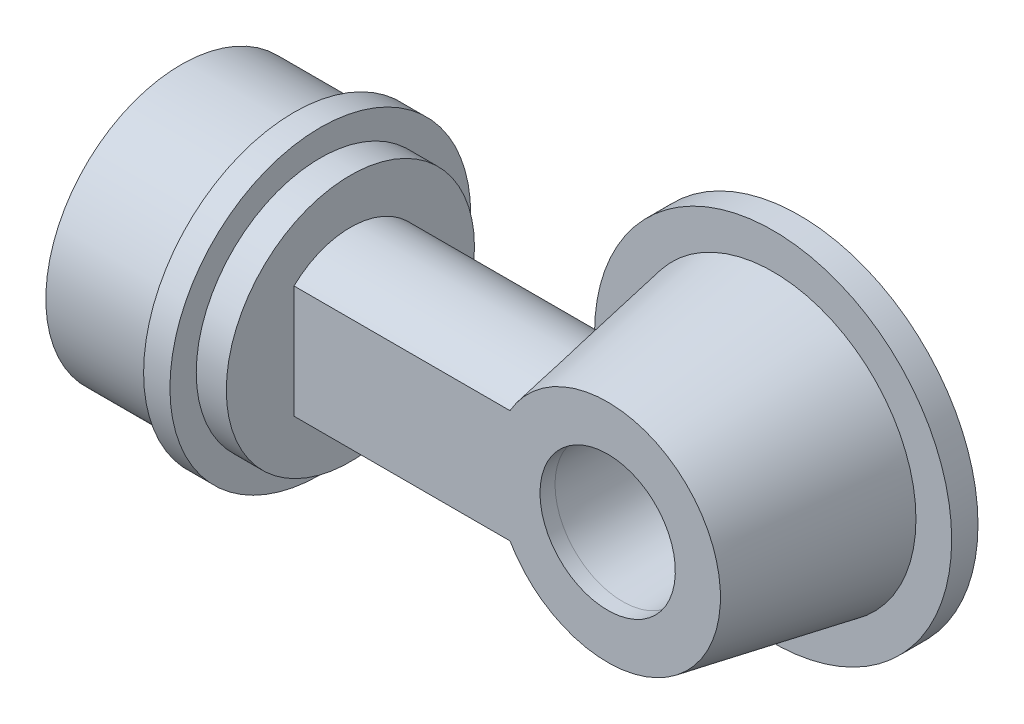
ISO-10303-21;
HEADER;
FILE_DESCRIPTION(('STEP AP214'),'2;1');
FILE_NAME('part.step','',(''),(''),'','','');
FILE_SCHEMA(('AUTOMOTIVE_DESIGN { 1 0 10303 214 1 1 1 1 }'));
ENDSEC;
DATA;
#1=APPLICATION_CONTEXT('core data for automotive mechanical design processes');
#2=APPLICATION_PROTOCOL_DEFINITION('international standard','automotive_design',2000,#1);
#3=PRODUCT_CONTEXT('',#1,'mechanical');
#4=PRODUCT('Part','Part','',(#3));
#5=PRODUCT_RELATED_PRODUCT_CATEGORY('part','',(#4));
#6=PRODUCT_DEFINITION_FORMATION('','',#4);
#7=PRODUCT_DEFINITION_CONTEXT('part definition',#1,'design');
#8=PRODUCT_DEFINITION('design','',#6,#7);
#9=PRODUCT_DEFINITION_SHAPE('','',#8);
#10=(LENGTH_UNIT() NAMED_UNIT(*) SI_UNIT(.MILLI.,.METRE.));
#11=(NAMED_UNIT(*) PLANE_ANGLE_UNIT() SI_UNIT($,.RADIAN.));
#12=(NAMED_UNIT(*) SI_UNIT($,.STERADIAN.) SOLID_ANGLE_UNIT());
#13=UNCERTAINTY_MEASURE_WITH_UNIT(LENGTH_MEASURE(1.E-05),#10,'distance_accuracy_value','');
#14=(GEOMETRIC_REPRESENTATION_CONTEXT(3) GLOBAL_UNCERTAINTY_ASSIGNED_CONTEXT((#13)) GLOBAL_UNIT_ASSIGNED_CONTEXT((#10,
#11,#12)) REPRESENTATION_CONTEXT('',''));
#15=CARTESIAN_POINT('',(0.,0.,0.));
#16=DIRECTION('',(0.,0.,1.));
#17=DIRECTION('',(1.,0.,0.));
#18=AXIS2_PLACEMENT_3D('',#15,#16,#17);
#19=CARTESIAN_POINT('',(64.2121426428143,0.,-16.5));
#20=DIRECTION('',(0.,0.,1.));
#21=DIRECTION('',(1.,0.,0.));
#22=AXIS2_PLACEMENT_3D('',#19,#20,#21);
#23=CONICAL_SURFACE('',#22,8.23174307118154,0.0349065850398869);
#24=CARTESIAN_POINT('',(64.2121426428143,0.,5.5));
#25=DIRECTION('',(0.,0.,-1.));
#26=DIRECTION('',(-1.,0.,0.));
#27=AXIS2_PLACEMENT_3D('',#24,#25,#26);
#28=CIRCLE('',#27,9.);
#29=CARTESIAN_POINT('',(55.2121426428143,0.,5.5));
#30=VERTEX_POINT('',#29);
#31=EDGE_CURVE('E283',#30,#30,#28,.T.);
#32=ORIENTED_EDGE('',*,*,#31,.F.);
#33=EDGE_LOOP('',(#32));
#34=FACE_BOUND('',#33,.T.);
#35=CARTESIAN_POINT('',(64.2121426428143,0.,-14.5));
#36=DIRECTION('',(0.,0.,-1.));
#37=DIRECTION('',(-1.,0.,0.));
#38=AXIS2_PLACEMENT_3D('',#35,#36,#37);
#39=CIRCLE('',#38,8.30158461016503);
#40=CARTESIAN_POINT('',(55.9105580326492,0.,-14.5));
#41=VERTEX_POINT('',#40);
#42=EDGE_CURVE('E12',#41,#41,#39,.F.);
#43=ORIENTED_EDGE('',*,*,#42,.F.);
#44=EDGE_LOOP('',(#43));
#45=FACE_BOUND('',#44,.T.);
#46=ADVANCED_FACE('F45',(#34,#45),#23,.F.);
#47=CARTESIAN_POINT('',(64.2121426428143,0.,7.5));
#48=DIRECTION('',(0.,0.,-1.));
#49=DIRECTION('',(-1.,0.,0.));
#50=AXIS2_PLACEMENT_3D('',#47,#48,#49);
#51=CONICAL_SURFACE('',#50,13.,0.179853499792478);
#52=CARTESIAN_POINT('',(64.2121426428143,0.,-14.5));
#53=DIRECTION('',(0.,0.,-1.));
#54=DIRECTION('',(-1.,0.,0.));
#55=AXIS2_PLACEMENT_3D('',#52,#53,#54);
#56=CIRCLE('',#55,17.);
#57=CARTESIAN_POINT('',(47.2121426428143,0.,-14.5));
#58=VERTEX_POINT('',#57);
#59=EDGE_CURVE('E296',#58,#58,#56,.T.);
#60=ORIENTED_EDGE('',*,*,#59,.T.);
#61=EDGE_LOOP('',(#60));
#62=FACE_BOUND('',#61,.T.);
#63=CARTESIAN_POINT('',(64.2121426428143,0.,5.5));
#64=DIRECTION('',(0.,0.,1.));
#65=DIRECTION('',(1.,0.,0.));
#66=AXIS2_PLACEMENT_3D('',#63,#64,#65);
#67=CIRCLE('',#66,13.3636363636364);
#68=CARTESIAN_POINT('',(52.586545292445,6.59031585787752,5.5));
#69=VERTEX_POINT('',#68);
#70=CARTESIAN_POINT('',(52.586545292445,-6.59031585787752,5.5));
#71=VERTEX_POINT('',#70);
#72=EDGE_CURVE('E115',#69,#71,#67,.F.);
#73=ORIENTED_EDGE('',*,*,#72,.F.);
#74=CARTESIAN_POINT('',(50.3336608037716,6.59015792785778,-5.5002));
#75=CARTESIAN_POINT('',(50.4511793389578,6.75120358124137,-5.29620400138417));
#76=CARTESIAN_POINT('',(50.5698271712072,6.90302721231492,-5.08557502860005));
#77=CARTESIAN_POINT('',(50.8071282492088,7.18775940080314,-4.65165008769355));
#78=CARTESIAN_POINT('',(50.9257814419699,7.32065480579924,-4.42834546103022));
#79=CARTESIAN_POINT('',(51.1616260379298,7.56783607383777,-3.96808871340667));
#80=CARTESIAN_POINT('',(51.2787977100561,7.68196183212613,-3.7310403859073));
#81=CARTESIAN_POINT('',(51.5080476988828,7.88942159590466,-3.24570262258721));
#82=CARTESIAN_POINT('',(51.6201276079781,7.98276213788075,-2.99741675036152));
#83=CARTESIAN_POINT('',(51.8172882641277,8.13305139628554,-2.53512786031201));
#84=CARTESIAN_POINT('',(51.9036430438113,8.19351544119522,-2.32280763989582));
#85=CARTESIAN_POINT('',(52.069319008144,8.29892262356999,-1.89155228563707));
#86=CARTESIAN_POINT('',(52.1486380801347,8.34386111072105,-1.67261519118336));
#87=CARTESIAN_POINT('',(52.2982167542973,8.41726169204217,-1.22963887097923));
#88=CARTESIAN_POINT('',(52.368501491112,8.44577030245546,-1.00561593468992));
#89=CARTESIAN_POINT('',(52.4984859249575,8.4856563433069,-0.553118103367679));
#90=CARTESIAN_POINT('',(52.5581914758635,8.49704327411528,-0.324645748546736));
#91=CARTESIAN_POINT('',(52.6660308527342,8.50197314991501,0.137772797732516));
#92=CARTESIAN_POINT('',(52.7140366267527,8.49532752516503,0.37175127362064));
#93=CARTESIAN_POINT('',(52.7963691070031,8.46320463518034,0.840844589497397));
#94=CARTESIAN_POINT('',(52.8306959900721,8.43772761340513,1.07595941475583));
#95=CARTESIAN_POINT('',(52.8849675749911,8.36769869683718,1.54501503488063));
#96=CARTESIAN_POINT('',(52.9049122613224,8.32314678146242,1.77895582847993));
#97=CARTESIAN_POINT('',(52.9304469005763,8.21513627408584,2.24320391412663));
#98=CARTESIAN_POINT('',(52.9360386151648,8.15168000344809,2.4735116486422));
#99=CARTESIAN_POINT('',(52.9338483439073,8.01697859426955,2.89516402803078));
#100=CARTESIAN_POINT('',(52.9278884387536,7.94819803479532,3.08731501141075));
#101=CARTESIAN_POINT('',(52.9069522562995,7.79775685356402,3.46600264614902));
#102=CARTESIAN_POINT('',(52.8919756934707,7.71609582398472,3.65253911951759));
#103=CARTESIAN_POINT('',(52.8541430898238,7.54054682102188,4.01882915687836));
#104=CARTESIAN_POINT('',(52.8312898994114,7.44666327837701,4.19858514852981));
#105=CARTESIAN_POINT('',(52.7789961657344,7.24731149567271,4.55048012636826));
#106=CARTESIAN_POINT('',(52.7495576418139,7.14184681192154,4.72262142820378));
#107=CARTESIAN_POINT('',(52.6974670439745,6.96154925286612,4.99565036537521));
#108=CARTESIAN_POINT('',(52.6764058123741,6.89004764471659,5.09906600173738));
#109=CARTESIAN_POINT('',(52.6326224141106,6.74307519936877,5.3022933977365));
#110=CARTESIAN_POINT('',(52.6099042830232,6.66761412403427,5.40211308382415));
#111=CARTESIAN_POINT('',(52.586497566265,6.59015792785778,5.5002));
#112=B_SPLINE_CURVE_WITH_KNOTS('',3,(#74,#75,#76,#77,#78,#79,#80,#81,#82,#83,#84,#85,#86,#87,
#88,#89,#90,#91,#92,#93,#94,#95,#96,#97,#98,#99,#100,#101,#102,#103,#104,#105,#106,#107,#108,
#109,#110,#111),.UNSPECIFIED.,.F.,.F.,(4,2,2,2,2,2,2,2,2,2,2,2,2,2,2,2,2,2,4),(0.,
0.85549305472784,1.71157768501838,2.57462332215403,3.43739716622864,4.14790666433151,
4.85862879463636,5.56732871724342,6.27563525557746,6.9913771512698,7.70710979373906,
8.42284320849303,9.13848877082001,9.75033771869488,10.3622060428587,10.9738531752873,
11.5853130070982,11.9676366754386,12.3490583930165),.UNSPECIFIED.);
#113=CARTESIAN_POINT('',(50.3337760527772,6.59031585787752,-5.49999999999999));
#114=VERTEX_POINT('',#113);
#115=EDGE_CURVE('E159',#114,#69,#112,.T.);
#116=ORIENTED_EDGE('',*,*,#115,.F.);
#117=CARTESIAN_POINT('',(64.2121426428143,0.,-5.5));
#118=DIRECTION('',(0.,0.,1.));
#119=DIRECTION('',(0.,-1.,0.));
#120=AXIS2_PLACEMENT_3D('',#117,#118,#119);
#121=CIRCLE('',#120,15.3636363636364);
#122=CARTESIAN_POINT('',(50.3337760527772,-6.59031585787751,-5.5));
#123=VERTEX_POINT('',#122);
#124=EDGE_CURVE('E117',#123,#114,#121,.F.);
#125=ORIENTED_EDGE('',*,*,#124,.F.);
#126=CARTESIAN_POINT('',(52.586497566265,-6.59015792785777,5.5002));
#127=CARTESIAN_POINT('',(52.6265155253654,-6.72257421970346,5.33253159573843));
#128=CARTESIAN_POINT('',(52.6645246001129,-6.84918727911524,5.1597301971513));
#129=CARTESIAN_POINT('',(52.7349028718415,-7.09015246511032,4.80449570540596));
#130=CARTESIAN_POINT('',(52.767267641703,-7.20449494044474,4.62205519662546));
#131=CARTESIAN_POINT('',(52.8247566038481,-7.42038982190652,4.24786131913101));
#132=CARTESIAN_POINT('',(52.8498580147072,-7.52190143534567,4.05608080674955));
#133=CARTESIAN_POINT('',(52.8910906203465,-7.71089923989395,3.66483769970449));
#134=CARTESIAN_POINT('',(52.9072240982582,-7.79838899676426,3.46537707414821));
#135=CARTESIAN_POINT('',(52.9292018879665,-7.95905860459968,3.05893706686427));
#136=CARTESIAN_POINT('',(52.9349896369063,-8.03215785668699,2.85192262846393));
#137=CARTESIAN_POINT('',(52.9350366977999,-8.16280961589199,2.43301609897865));
#138=CARTESIAN_POINT('',(52.9292954099314,-8.22036131393906,2.22112375467747));
#139=CARTESIAN_POINT('',(52.9057241534149,-8.31935352359084,1.7948768916822));
#140=CARTESIAN_POINT('',(52.8879271332362,-8.360837464134,1.5805306451589));
#141=CARTESIAN_POINT('',(52.8402322575763,-8.42777358543002,1.15070029570116));
#142=CARTESIAN_POINT('',(52.8103350158783,-8.45322657918451,0.935216251028575));
#143=CARTESIAN_POINT('',(52.7415981237657,-8.48694212151017,0.521043359614839));
#144=CARTESIAN_POINT('',(52.7035969352677,-8.49635039119767,0.322306519090202));
#145=CARTESIAN_POINT('',(52.6183647203829,-8.50190421718482,-0.0733921231799957));
#146=CARTESIAN_POINT('',(52.5711308287694,-8.49804565014415,-0.270353353991791));
#147=CARTESIAN_POINT('',(52.4167920483047,-8.46717093562999,-0.857483586157214));
#148=CARTESIAN_POINT('',(52.297128864865,-8.42082073023992,-1.24344229919686));
#149=CARTESIAN_POINT('',(51.9870502602829,-8.25626341309419,-2.12958801434503));
#150=CARTESIAN_POINT('',(51.7865177040986,-8.11862281316861,-2.62262688192274));
#151=CARTESIAN_POINT('',(51.4683339009119,-7.854706587928,-3.33187029469028));
#152=CARTESIAN_POINT('',(51.3593054066468,-7.75708375460262,-3.56336038445617));
#153=CARTESIAN_POINT('',(51.1376745545922,-7.54339655027553,-4.01586002735996));
#154=CARTESIAN_POINT('',(51.0250737147764,-7.42733993040996,-4.2368739350855));
#155=CARTESIAN_POINT('',(50.8154468876291,-7.19614588227929,-4.63554447985656));
#156=CARTESIAN_POINT('',(50.7186115200935,-7.08346941501126,-4.81474029262609));
#157=CARTESIAN_POINT('',(50.5254957824767,-6.84592552350863,-5.16413065226173));
#158=CARTESIAN_POINT('',(50.4292146350222,-6.72109949171164,-5.33435291270703));
#159=CARTESIAN_POINT('',(50.3336608037716,-6.59015792785777,-5.5002));
#160=B_SPLINE_CURVE_WITH_KNOTS('',3,(#126,#127,#128,#129,#130,#131,#132,#133,#134,#135,#136,
#137,#138,#139,#140,#141,#142,#143,#144,#145,#146,#147,#148,#149,#150,#151,#152,#153,#154,#155,
#156,#157,#158,#159),.UNSPECIFIED.,.F.,.F.,(4,2,2,2,2,2,2,2,2,2,2,2,2,2,2,2,4),(0.,
0.652035878266516,1.30458090398809,1.95915097725829,2.61355432818645,3.27152465867902,
3.92952922233527,4.58574266817086,5.2419228317828,5.84890857901493,6.45608299480988,
7.67181068686589,9.31185594031045,10.1328516033866,10.9535029593317,11.6513580178833,
12.3469136492407),.UNSPECIFIED.);
#161=EDGE_CURVE('E110',#71,#123,#160,.T.);
#162=ORIENTED_EDGE('',*,*,#161,.F.);
#163=EDGE_LOOP('',(#73,#116,#125,#162));
#164=FACE_BOUND('',#163,.T.);
#165=ADVANCED_FACE('F112',(#62,#164),#51,.F.);
#166=CARTESIAN_POINT('',(19.5,0.,0.));
#167=DIRECTION('',(1.,0.,0.));
#168=DIRECTION('',(0.,0.,-1.));
#169=AXIS2_PLACEMENT_3D('',#166,#167,#168);
#170=PLANE('',#169);
#171=CARTESIAN_POINT('',(19.5,0.,0.));
#172=DIRECTION('',(1.,0.,0.));
#173=DIRECTION('',(0.,0.,-1.));
#174=AXIS2_PLACEMENT_3D('',#171,#172,#173);
#175=CIRCLE('',#174,13.5);
#176=CARTESIAN_POINT('',(19.5,0.,-13.5));
#177=VERTEX_POINT('',#176);
#178=EDGE_CURVE('E551',#177,#177,#175,.T.);
#179=ORIENTED_EDGE('',*,*,#178,.F.);
#180=EDGE_LOOP('',(#179));
#181=FACE_BOUND('',#180,.T.);
#182=CARTESIAN_POINT('',(19.5,-0.374999999999999,0.));
#183=DIRECTION('',(1.,0.,0.));
#184=DIRECTION('',(0.,0.,-1.));
#185=AXIS2_PLACEMENT_3D('',#182,#183,#184);
#186=CIRCLE('',#185,8.875);
#187=CARTESIAN_POINT('',(19.5,6.59031585787752,5.5));
#188=VERTEX_POINT('',#187);
#189=CARTESIAN_POINT('',(19.5,6.59031585787752,-5.5));
#190=VERTEX_POINT('',#189);
#191=EDGE_CURVE('E165',#188,#190,#186,.F.);
#192=ORIENTED_EDGE('',*,*,#191,.F.);
#193=DIRECTION('',(0.,1.,0.));
#194=VECTOR('',#193,1.);
#195=CARTESIAN_POINT('',(19.5,0.,5.5));
#196=LINE('',#195,#194);
#197=CARTESIAN_POINT('',(19.5,-6.59031585787751,5.5));
#198=VERTEX_POINT('',#197);
#199=EDGE_CURVE('E120',#198,#188,#196,.T.);
#200=ORIENTED_EDGE('',*,*,#199,.F.);
#201=CARTESIAN_POINT('',(19.5,0.374999999999999,0.));
#202=DIRECTION('',(1.,0.,0.));
#203=DIRECTION('',(0.,0.,-1.));
#204=AXIS2_PLACEMENT_3D('',#201,#202,#203);
#205=CIRCLE('',#204,8.875);
#206=CARTESIAN_POINT('',(19.5,-6.59031585787752,-5.5));
#207=VERTEX_POINT('',#206);
#208=EDGE_CURVE('E119',#207,#198,#205,.F.);
#209=ORIENTED_EDGE('',*,*,#208,.F.);
#210=DIRECTION('',(0.,-1.,0.));
#211=VECTOR('',#210,1.);
#212=CARTESIAN_POINT('',(19.5,0.,-5.5));
#213=LINE('',#212,#211);
#214=EDGE_CURVE('E135',#190,#207,#213,.T.);
#215=ORIENTED_EDGE('',*,*,#214,.F.);
#216=EDGE_LOOP('',(#192,#200,#209,#215));
#217=FACE_BOUND('',#216,.T.);
#218=ADVANCED_FACE('F210',(#181,#217),#170,.F.);
#219=CARTESIAN_POINT('',(22.5,0.,0.));
#220=DIRECTION('',(1.,0.,0.));
#221=DIRECTION('',(0.,0.,-1.));
#222=AXIS2_PLACEMENT_3D('',#219,#220,#221);
#223=PLANE('',#222);
#224=CARTESIAN_POINT('',(22.5,0.,0.));
#225=DIRECTION('',(1.,0.,0.));
#226=DIRECTION('',(0.,0.,-1.));
#227=AXIS2_PLACEMENT_3D('',#224,#225,#226);
#228=CIRCLE('',#227,16.5);
#229=CARTESIAN_POINT('',(22.5,0.,-16.5));
#230=VERTEX_POINT('',#229);
#231=EDGE_CURVE('E563',#230,#230,#228,.T.);
#232=ORIENTED_EDGE('',*,*,#231,.T.);
#233=EDGE_LOOP('',(#232));
#234=FACE_BOUND('',#233,.T.);
#235=DIRECTION('',(0.,1.,0.));
#236=VECTOR('',#235,1.);
#237=CARTESIAN_POINT('',(22.5,7.5,-7.5));
#238=LINE('',#237,#236);
#239=CARTESIAN_POINT('',(22.5,-7.5,-7.5));
#240=VERTEX_POINT('',#239);
#241=CARTESIAN_POINT('',(22.5,7.5,-7.5));
#242=VERTEX_POINT('',#241);
#243=EDGE_CURVE('E545',#240,#242,#238,.T.);
#244=ORIENTED_EDGE('',*,*,#243,.F.);
#245=CARTESIAN_POINT('',(22.5,0.374999999999999,0.));
#246=DIRECTION('',(1.,0.,0.));
#247=DIRECTION('',(0.,0.,-1.));
#248=AXIS2_PLACEMENT_3D('',#245,#246,#247);
#249=CIRCLE('',#248,10.875);
#250=CARTESIAN_POINT('',(22.5,-7.5,7.5));
#251=VERTEX_POINT('',#250);
#252=EDGE_CURVE('E596',#251,#240,#249,.T.);
#253=ORIENTED_EDGE('',*,*,#252,.F.);
#254=DIRECTION('',(0.,-1.,0.));
#255=VECTOR('',#254,1.);
#256=CARTESIAN_POINT('',(22.5,7.5,7.5));
#257=LINE('',#256,#255);
#258=CARTESIAN_POINT('',(22.5,7.5,7.5));
#259=VERTEX_POINT('',#258);
#260=EDGE_CURVE('E587',#259,#251,#257,.T.);
#261=ORIENTED_EDGE('',*,*,#260,.F.);
#262=CARTESIAN_POINT('',(22.5,-0.374999999999999,0.));
#263=DIRECTION('',(1.,0.,0.));
#264=DIRECTION('',(0.,0.,1.));
#265=AXIS2_PLACEMENT_3D('',#262,#263,#264);
#266=CIRCLE('',#265,10.875);
#267=EDGE_CURVE('E593',#242,#259,#266,.T.);
#268=ORIENTED_EDGE('',*,*,#267,.F.);
#269=EDGE_LOOP('',(#244,#253,#261,#268));
#270=FACE_BOUND('',#269,.T.);
#271=ADVANCED_FACE('F213',(#234,#270),#223,.T.);
#272=CARTESIAN_POINT('',(22.5,0.,0.));
#273=DIRECTION('',(-1.,0.,0.));
#274=DIRECTION('',(0.,0.,1.));
#275=AXIS2_PLACEMENT_3D('',#272,#273,#274);
#276=CYLINDRICAL_SURFACE('',#275,13.5);
#277=CARTESIAN_POINT('',(18.5,0.,0.));
#278=DIRECTION('',(1.,0.,0.));
#279=DIRECTION('',(0.,0.,-1.));
#280=AXIS2_PLACEMENT_3D('',#277,#278,#279);
#281=CIRCLE('',#280,13.5);
#282=CARTESIAN_POINT('',(18.5,0.,-13.5));
#283=VERTEX_POINT('',#282);
#284=EDGE_CURVE('E559',#283,#283,#281,.T.);
#285=ORIENTED_EDGE('',*,*,#284,.F.);
#286=EDGE_LOOP('',(#285));
#287=FACE_BOUND('',#286,.T.);
#288=ORIENTED_EDGE('',*,*,#178,.T.);
#289=EDGE_LOOP('',(#288));
#290=FACE_BOUND('',#289,.T.);
#291=ADVANCED_FACE('F215',(#287,#290),#276,.F.);
#292=CARTESIAN_POINT('',(0.,0.,0.));
#293=DIRECTION('',(1.,0.,0.));
#294=DIRECTION('',(0.,0.,-1.));
#295=AXIS2_PLACEMENT_3D('',#292,#293,#294);
#296=PLANE('',#295);
#297=CARTESIAN_POINT('',(0.,0.,0.));
#298=DIRECTION('',(1.,0.,0.));
#299=DIRECTION('',(0.,0.,-1.));
#300=AXIS2_PLACEMENT_3D('',#297,#298,#299);
#301=CIRCLE('',#300,18.);
#302=CARTESIAN_POINT('',(0.,0.,-18.));
#303=VERTEX_POINT('',#302);
#304=EDGE_CURVE('E580',#303,#303,#301,.T.);
#305=ORIENTED_EDGE('',*,*,#304,.F.);
#306=EDGE_LOOP('',(#305));
#307=FACE_BOUND('',#306,.T.);
#308=CARTESIAN_POINT('',(0.,0.,0.));
#309=DIRECTION('',(1.,0.,0.));
#310=DIRECTION('',(0.,0.,-1.));
#311=AXIS2_PLACEMENT_3D('',#308,#309,#310);
#312=CIRCLE('',#311,15.5);
#313=CARTESIAN_POINT('',(0.,0.,-15.5));
#314=VERTEX_POINT('',#313);
#315=EDGE_CURVE('E575',#314,#314,#312,.T.);
#316=ORIENTED_EDGE('',*,*,#315,.T.);
#317=EDGE_LOOP('',(#316));
#318=FACE_BOUND('',#317,.T.);
#319=ADVANCED_FACE('F218',(#307,#318),#296,.F.);
#320=CARTESIAN_POINT('',(15.,0.,0.));
#321=DIRECTION('',(-1.,0.,0.));
#322=DIRECTION('',(0.,0.,1.));
#323=AXIS2_PLACEMENT_3D('',#320,#321,#322);
#324=CYLINDRICAL_SURFACE('',#323,18.);
#325=CARTESIAN_POINT('',(15.,0.,0.));
#326=DIRECTION('',(1.,0.,0.));
#327=DIRECTION('',(0.,0.,-1.));
#328=AXIS2_PLACEMENT_3D('',#325,#326,#327);
#329=CIRCLE('',#328,18.);
#330=CARTESIAN_POINT('',(15.,0.,-18.));
#331=VERTEX_POINT('',#330);
#332=EDGE_CURVE('E54',#331,#331,#329,.T.);
#333=ORIENTED_EDGE('',*,*,#332,.F.);
#334=EDGE_LOOP('',(#333));
#335=FACE_BOUND('',#334,.T.);
#336=ORIENTED_EDGE('',*,*,#304,.T.);
#337=EDGE_LOOP('',(#336));
#338=FACE_BOUND('',#337,.T.);
#339=ADVANCED_FACE('F47',(#335,#338),#324,.T.);
#340=CARTESIAN_POINT('',(15.,0.,0.));
#341=DIRECTION('',(-1.,0.,0.));
#342=DIRECTION('',(0.,0.,1.));
#343=AXIS2_PLACEMENT_3D('',#340,#341,#342);
#344=CYLINDRICAL_SURFACE('',#343,15.5);
#345=ORIENTED_EDGE('',*,*,#315,.F.);
#346=EDGE_LOOP('',(#345));
#347=FACE_BOUND('',#346,.T.);
#348=CARTESIAN_POINT('',(18.5,0.,0.));
#349=DIRECTION('',(1.,0.,0.));
#350=DIRECTION('',(0.,0.,-1.));
#351=AXIS2_PLACEMENT_3D('',#348,#349,#350);
#352=CIRCLE('',#351,15.5);
#353=CARTESIAN_POINT('',(18.5,0.,-15.5));
#354=VERTEX_POINT('',#353);
#355=EDGE_CURVE('E566',#354,#354,#352,.T.);
#356=ORIENTED_EDGE('',*,*,#355,.T.);
#357=EDGE_LOOP('',(#356));
#358=FACE_BOUND('',#357,.T.);
#359=ADVANCED_FACE('F235',(#347,#358),#344,.F.);
#360=CARTESIAN_POINT('',(18.5,0.,0.));
#361=DIRECTION('',(1.,0.,0.));
#362=DIRECTION('',(0.,0.,-1.));
#363=AXIS2_PLACEMENT_3D('',#360,#361,#362);
#364=PLANE('',#363);
#365=CARTESIAN_POINT('',(18.5,0.,0.));
#366=DIRECTION('',(1.,0.,0.));
#367=DIRECTION('',(0.,0.,-1.));
#368=AXIS2_PLACEMENT_3D('',#365,#366,#367);
#369=CIRCLE('',#368,16.5);
#370=CARTESIAN_POINT('',(18.5,0.,-16.5));
#371=VERTEX_POINT('',#370);
#372=EDGE_CURVE('E562',#371,#371,#369,.T.);
#373=ORIENTED_EDGE('',*,*,#372,.F.);
#374=EDGE_LOOP('',(#373));
#375=FACE_BOUND('',#374,.T.);
#376=CARTESIAN_POINT('',(18.5,0.,0.));
#377=DIRECTION('',(1.,0.,0.));
#378=DIRECTION('',(0.,0.,-1.));
#379=AXIS2_PLACEMENT_3D('',#376,#377,#378);
#380=CIRCLE('',#379,20.);
#381=CARTESIAN_POINT('',(18.5,0.,-20.));
#382=VERTEX_POINT('',#381);
#383=EDGE_CURVE('E572',#382,#382,#380,.T.);
#384=ORIENTED_EDGE('',*,*,#383,.T.);
#385=EDGE_LOOP('',(#384));
#386=FACE_BOUND('',#385,.T.);
#387=ADVANCED_FACE('F231',(#375,#386),#364,.T.);
#388=CARTESIAN_POINT('',(15.,0.,0.));
#389=DIRECTION('',(1.,0.,0.));
#390=DIRECTION('',(0.,0.,-1.));
#391=AXIS2_PLACEMENT_3D('',#388,#389,#390);
#392=PLANE('',#391);
#393=ORIENTED_EDGE('',*,*,#332,.T.);
#394=EDGE_LOOP('',(#393));
#395=FACE_BOUND('',#394,.T.);
#396=CARTESIAN_POINT('',(15.,0.,0.));
#397=DIRECTION('',(1.,0.,0.));
#398=DIRECTION('',(0.,0.,-1.));
#399=AXIS2_PLACEMENT_3D('',#396,#397,#398);
#400=CIRCLE('',#399,20.);
#401=CARTESIAN_POINT('',(15.,0.,-20.));
#402=VERTEX_POINT('',#401);
#403=EDGE_CURVE('E571',#402,#402,#400,.T.);
#404=ORIENTED_EDGE('',*,*,#403,.F.);
#405=EDGE_LOOP('',(#404));
#406=FACE_BOUND('',#405,.T.);
#407=ADVANCED_FACE('F234',(#395,#406),#392,.F.);
#408=CARTESIAN_POINT('',(18.5,0.,0.));
#409=DIRECTION('',(-1.,0.,0.));
#410=DIRECTION('',(0.,0.,1.));
#411=AXIS2_PLACEMENT_3D('',#408,#409,#410);
#412=CYLINDRICAL_SURFACE('',#411,20.);
#413=ORIENTED_EDGE('',*,*,#383,.F.);
#414=EDGE_LOOP('',(#413));
#415=FACE_BOUND('',#414,.T.);
#416=ORIENTED_EDGE('',*,*,#403,.T.);
#417=EDGE_LOOP('',(#416));
#418=FACE_BOUND('',#417,.T.);
#419=ADVANCED_FACE('F226',(#415,#418),#412,.T.);
#420=CARTESIAN_POINT('',(18.5,0.,0.));
#421=DIRECTION('',(1.,0.,0.));
#422=DIRECTION('',(0.,0.,-1.));
#423=AXIS2_PLACEMENT_3D('',#420,#421,#422);
#424=PLANE('',#423);
#425=ORIENTED_EDGE('',*,*,#284,.T.);
#426=EDGE_LOOP('',(#425));
#427=FACE_BOUND('',#426,.T.);
#428=ORIENTED_EDGE('',*,*,#355,.F.);
#429=EDGE_LOOP('',(#428));
#430=FACE_BOUND('',#429,.T.);
#431=ADVANCED_FACE('F223',(#427,#430),#424,.F.);
#432=CARTESIAN_POINT('',(22.5,0.,0.));
#433=DIRECTION('',(-1.,0.,0.));
#434=DIRECTION('',(0.,0.,1.));
#435=AXIS2_PLACEMENT_3D('',#432,#433,#434);
#436=CYLINDRICAL_SURFACE('',#435,16.5);
#437=ORIENTED_EDGE('',*,*,#231,.F.);
#438=EDGE_LOOP('',(#437));
#439=FACE_BOUND('',#438,.T.);
#440=ORIENTED_EDGE('',*,*,#372,.T.);
#441=EDGE_LOOP('',(#440));
#442=FACE_BOUND('',#441,.T.);
#443=ADVANCED_FACE('F208',(#439,#442),#436,.T.);
#444=CARTESIAN_POINT('',(53.5,0.374999999999999,0.));
#445=DIRECTION('',(-1.,0.,0.));
#446=DIRECTION('',(0.,0.,1.));
#447=AXIS2_PLACEMENT_3D('',#444,#445,#446);
#448=CYLINDRICAL_SURFACE('',#447,10.875);
#449=DIRECTION('',(-1.,0.,0.));
#450=VECTOR('',#449,1.);
#451=CARTESIAN_POINT('',(53.5,-7.5,-7.5));
#452=LINE('',#451,#450);
#453=CARTESIAN_POINT('',(48.1495712936464,-7.5,-7.5));
#454=VERTEX_POINT('',#453);
#455=EDGE_CURVE('E548',#454,#240,#452,.T.);
#456=ORIENTED_EDGE('',*,*,#455,.F.);
#457=CARTESIAN_POINT('',(48.1494357728176,-7.49979999999979,-7.50020999439371));
#458=CARTESIAN_POINT('',(48.1494379228036,-7.49980317299087,-7.50020666293097));
#459=CARTESIAN_POINT('',(48.1494400727902,-7.49980634597966,-7.5002033314664));
#460=CARTESIAN_POINT('',(48.3056752507237,-7.73038079070351,-7.2581124762505));
#461=CARTESIAN_POINT('',(48.4652605055546,-7.94884527903093,-7.00638579670923));
#462=CARTESIAN_POINT('',(48.7878062109275,-8.36094628926732,-6.4853157910802));
#463=CARTESIAN_POINT('',(48.9507682175319,-8.55457105517267,-6.2159642139765));
#464=CARTESIAN_POINT('',(49.2773013551838,-8.91704532697401,-5.65985986001398));
#465=CARTESIAN_POINT('',(49.4408727600273,-9.0858131715266,-5.37305391783995));
#466=CARTESIAN_POINT('',(49.7645168165552,-9.39701998418403,-4.78374817819937));
#467=CARTESIAN_POINT('',(49.924590774421,-9.53946893502725,-4.48125438710948));
#468=CARTESIAN_POINT('',(50.2099229634254,-9.77438739294535,-3.91562881694263));
#469=CARTESIAN_POINT('',(50.3363605356085,-9.87124082855298,-3.65490745563309));
#470=CARTESIAN_POINT('',(50.5818098349282,-10.045505052446,-3.12359641251645));
#471=CARTESIAN_POINT('',(50.7008214677417,-10.1229155938084,-2.85300660543095));
#472=CARTESIAN_POINT('',(50.9284463524131,-10.257062437103,-2.30320603931149));
#473=CARTESIAN_POINT('',(51.0370827103178,-10.3138455077224,-2.02401635908997));
#474=CARTESIAN_POINT('',(51.2413203332606,-10.4057133218187,-1.45744076511113));
#475=CARTESIAN_POINT('',(51.3369261787552,-10.4408057053709,-1.17005777462462));
#476=CARTESIAN_POINT('',(51.4946146467691,-10.4832604034615,-0.646740039158328));
#477=CARTESIAN_POINT('',(51.559578068787,-10.4947639064028,-0.412005726860621));
#478=CARTESIAN_POINT('',(51.6777958033835,-10.5023961276447,0.0605366719587677));
#479=CARTESIAN_POINT('',(51.7310568418703,-10.4985337019848,0.298342909240782));
#480=CARTESIAN_POINT('',(51.8246606911811,-10.4749382972751,0.775558544875011));
#481=CARTESIAN_POINT('',(51.8650121865376,-10.4552160190098,1.0149667543911));
#482=CARTESIAN_POINT('',(51.9320133035955,-10.3996072976698,1.4938396262439));
#483=CARTESIAN_POINT('',(51.9586628890554,-10.3637208118415,1.73330428872824));
#484=CARTESIAN_POINT('',(51.9979820004958,-10.2756743326108,2.21084017371752));
#485=CARTESIAN_POINT('',(52.0106259313105,-10.2234847678408,2.44890805678759));
#486=CARTESIAN_POINT('',(52.0221265927371,-10.1031221561675,2.92130055843765));
#487=CARTESIAN_POINT('',(52.0209830717748,-10.0349488176371,3.15562510863642));
#488=CARTESIAN_POINT('',(52.0057491998508,-9.88305441931744,3.6190440566563));
#489=CARTESIAN_POINT('',(51.9916431217739,-9.79931457158185,3.84813175464126));
#490=CARTESIAN_POINT('',(51.9517786758747,-9.61705017830553,4.29927475141104));
#491=CARTESIAN_POINT('',(51.9260202014049,-9.51852549745336,4.52132998581193));
#492=CARTESIAN_POINT('',(51.864796337403,-9.30857892481795,4.95492925174666));
#493=CARTESIAN_POINT('',(51.8294360481737,-9.1973038095274,5.16655936184604));
#494=CARTESIAN_POINT('',(51.7506128009194,-8.96178947935917,5.58093760497547));
#495=CARTESIAN_POINT('',(51.7071464666409,-8.83754487207899,5.78368199339354));
#496=CARTESIAN_POINT('',(51.5673851105606,-8.44682715089226,6.37688710553581));
#497=CARTESIAN_POINT('',(51.4615764352147,-8.16189849556836,6.7532874000678));
#498=CARTESIAN_POINT('',(51.3079155142697,-7.73983645211653,7.24198232168819));
#499=CARTESIAN_POINT('',(51.265065332697,-7.62133209660362,7.37260778250091));
#500=CARTESIAN_POINT('',(51.2216924699581,-7.49980634597945,7.50020333146664));
#501=CARTESIAN_POINT('',(51.2216913375104,-7.49980317299067,7.50020666293121));
#502=CARTESIAN_POINT('',(51.2216902050623,-7.49979999999982,7.50020999439371));
#503=B_SPLINE_CURVE_WITH_KNOTS('',3,(#457,#458,#459,#460,#461,#462,#463,#464,#465,#466,#467,
#468,#469,#470,#471,#472,#473,#474,#475,#476,#477,#478,#479,#480,#481,#482,#483,#484,#485,#486,
#487,#488,#489,#490,#491,#492,#493,#494,#495,#496,#497,#498,#499,#500,#501,#502),.UNSPECIFIED.,
.F.,.F.,(4,2,2,2,2,2,2,2,2,2,2,2,2,2,2,2,2,2,2,2,2,2,4),(0.,1.52348484500291E-05,
1.10708530465028,2.21467740442878,3.32583073347474,4.43656173369394,5.35233340424138,
6.26811670441787,7.18181049399393,8.09518227102025,8.82595505493277,9.55630672437688,
10.2861660320529,11.0160272701886,11.747220131657,12.4784263349294,13.2105208636232,
13.9426220928865,14.6670121273325,15.3917045544824,16.8378559660227,17.3822432928359,
17.3822575069334),.UNSPECIFIED.);
#504=CARTESIAN_POINT('',(51.2217622239526,-7.49999963168097,7.5));
#505=VERTEX_POINT('',#504);
#506=EDGE_CURVE('E201',#454,#505,#503,.T.);
#507=ORIENTED_EDGE('',*,*,#506,.T.);
#508=DIRECTION('',(-1.,0.,0.));
#509=VECTOR('',#508,1.);
#510=CARTESIAN_POINT('',(53.5,-7.5,7.5));
#511=LINE('',#510,#509);
#512=EDGE_CURVE('E553',#505,#251,#511,.T.);
#513=ORIENTED_EDGE('',*,*,#512,.T.);
#514=ORIENTED_EDGE('',*,*,#252,.T.);
#515=EDGE_LOOP('',(#456,#507,#513,#514));
#516=FACE_BOUND('',#515,.T.);
#517=ADVANCED_FACE('F203',(#516),#448,.T.);
#518=CARTESIAN_POINT('',(53.5,7.5,-7.5));
#519=DIRECTION('',(0.,0.,1.));
#520=DIRECTION('',(1.,0.,0.));
#521=AXIS2_PLACEMENT_3D('',#518,#519,#520);
#522=PLANE('',#521);
#523=DIRECTION('',(-1.,0.,0.));
#524=VECTOR('',#523,1.);
#525=CARTESIAN_POINT('',(53.5,7.5,-7.5));
#526=LINE('',#525,#524);
#527=CARTESIAN_POINT('',(48.1495712936464,7.5,-7.5));
#528=VERTEX_POINT('',#527);
#529=EDGE_CURVE('E542',#528,#242,#526,.T.);
#530=ORIENTED_EDGE('',*,*,#529,.F.);
#531=CARTESIAN_POINT('',(64.2121426428143,0.,-7.5));
#532=DIRECTION('',(0.,0.,1.));
#533=DIRECTION('',(1.,0.,0.));
#534=AXIS2_PLACEMENT_3D('',#531,#532,#533);
#535=CIRCLE('',#534,17.7272727272727);
#536=EDGE_CURVE('E171',#528,#454,#535,.T.);
#537=ORIENTED_EDGE('',*,*,#536,.T.);
#538=ORIENTED_EDGE('',*,*,#455,.T.);
#539=ORIENTED_EDGE('',*,*,#243,.T.);
#540=EDGE_LOOP('',(#530,#537,#538,#539));
#541=FACE_BOUND('',#540,.T.);
#542=ADVANCED_FACE('F207',(#541),#522,.F.);
#543=CARTESIAN_POINT('',(53.5,-0.374999999999999,0.));
#544=DIRECTION('',(-1.,0.,0.));
#545=DIRECTION('',(0.,0.,1.));
#546=AXIS2_PLACEMENT_3D('',#543,#544,#545);
#547=CYLINDRICAL_SURFACE('',#546,10.875);
#548=DIRECTION('',(-1.,0.,0.));
#549=VECTOR('',#548,1.);
#550=CARTESIAN_POINT('',(53.5,7.5,7.5));
#551=LINE('',#550,#549);
#552=CARTESIAN_POINT('',(51.2217604911024,7.50000063213758,7.5));
#553=VERTEX_POINT('',#552);
#554=EDGE_CURVE('E549',#553,#259,#551,.T.);
#555=ORIENTED_EDGE('',*,*,#554,.F.);
#556=CARTESIAN_POINT('',(51.2216902050623,7.4997999999998,7.5002099943937));
#557=CARTESIAN_POINT('',(51.2216913375104,7.49980317299062,7.50020666293123));
#558=CARTESIAN_POINT('',(51.2216924699582,7.49980634597941,7.50020333146666));
#559=CARTESIAN_POINT('',(51.2875001534938,7.68419187216447,7.30660837438554));
#560=CARTESIAN_POINT('',(51.3521441074102,7.86170841758138,7.10592768316882));
#561=CARTESIAN_POINT('',(51.4767327963094,8.20210821374502,6.69110353022649));
#562=CARTESIAN_POINT('',(51.5366763244498,8.36498770796075,6.47695663629603));
#563=CARTESIAN_POINT('',(51.6495208489108,8.67562616648273,6.0352996879308));
#564=CARTESIAN_POINT('',(51.7024035752434,8.82334568417347,5.80775708063571));
#565=CARTESIAN_POINT('',(51.7983004756348,9.10207971069752,5.34082966193775));
#566=CARTESIAN_POINT('',(51.841320547674,9.23310418242398,5.10145203269057));
#567=CARTESIAN_POINT('',(51.9152588048332,9.47851432861809,4.60977396434021));
#568=CARTESIAN_POINT('',(51.9460669692936,9.59274315139706,4.35737821153449));
#569=CARTESIAN_POINT('',(51.9925856459971,9.80199591773979,3.84335272152105));
#570=CARTESIAN_POINT('',(52.0082961137693,9.89701980473389,3.58172295711649));
#571=CARTESIAN_POINT('',(52.0226666689726,10.0666411780233,3.05203533393146));
#572=CARTESIAN_POINT('',(52.021362065179,10.1412806362823,2.78399193854595));
#573=CARTESIAN_POINT('',(52.0006590390142,10.2696591777961,2.24364430441881));
#574=CARTESIAN_POINT('',(51.9812629795912,10.3234009892203,1.97134062668478));
#575=CARTESIAN_POINT('',(51.927847265406,10.4043028849898,1.45968440514051));
#576=CARTESIAN_POINT('',(51.89597352407,10.4339559899634,1.22049473103885));
#577=CARTESIAN_POINT('',(51.818843159768,10.4772475939581,0.742859362723196));
#578=CARTESIAN_POINT('',(51.7735878860746,10.4908877068954,0.504413595948711));
#579=CARTESIAN_POINT('',(51.6706372641611,10.5025544486457,0.0296494068718382));
#580=CARTESIAN_POINT('',(51.612931312077,10.5005677170944,-0.206667022101125));
#581=CARTESIAN_POINT('',(51.4863872189031,10.4815231116055,-0.675788786153182));
#582=CARTESIAN_POINT('',(51.417542665775,10.4644565314167,-0.908592013926591));
#583=CARTESIAN_POINT('',(51.2486160576442,10.4087830449708,-1.43717456719095));
#584=CARTESIAN_POINT('',(51.1452924587931,10.365328948656,-1.73141344872457));
#585=CARTESIAN_POINT('',(50.9258037614125,10.2557569231585,-2.31076278535228));
#586=CARTESIAN_POINT('',(50.8096338941904,10.1896305584887,-2.59586979959436));
#587=CARTESIAN_POINT('',(50.5673746744566,10.0358858893272,-3.15653926638806));
#588=CARTESIAN_POINT('',(50.4412666189264,9.9482263715881,-3.43208224590638));
#589=CARTESIAN_POINT('',(50.182206395946,9.75257862357632,-3.97244846506897));
#590=CARTESIAN_POINT('',(50.0492547954173,9.64459207523889,-4.23727258943055));
#591=CARTESIAN_POINT('',(49.7694370968322,9.40072682817003,-4.77429008602201));
#592=CARTESIAN_POINT('',(49.6222544576674,9.26340918891404,-5.04566454519953));
#593=CARTESIAN_POINT('',(49.3257884141056,8.96710228861871,-5.57519625103014));
#594=CARTESIAN_POINT('',(49.1765045309614,8.80810801468408,-5.83335042133328));
#595=CARTESIAN_POINT('',(48.8789421648418,8.46950140268732,-6.33496085914155));
#596=CARTESIAN_POINT('',(48.7306620116061,8.28995189391441,-6.57845861894992));
#597=CARTESIAN_POINT('',(48.4371423334126,7.91022384988767,-7.05070284847149));
#598=CARTESIAN_POINT('',(48.2919016346805,7.71005346171301,-7.27945508634409));
#599=CARTESIAN_POINT('',(48.1494400727902,7.49980634597967,-7.50020333146639));
#600=CARTESIAN_POINT('',(48.1494379228036,7.49980317299088,-7.50020666293096));
#601=CARTESIAN_POINT('',(48.1494357728176,7.49979999999979,-7.50020999439371));
#602=B_SPLINE_CURVE_WITH_KNOTS('',3,(#556,#557,#558,#559,#560,#561,#562,#563,#564,#565,#566,
#567,#568,#569,#570,#571,#572,#573,#574,#575,#576,#577,#578,#579,#580,#581,#582,#583,#584,#585,
#586,#587,#588,#589,#590,#591,#592,#593,#594,#595,#596,#597,#598,#599,#600,#601),.UNSPECIFIED.,
.F.,.F.,(4,2,2,2,2,2,2,2,2,2,2,2,2,2,2,2,2,2,2,2,2,2,4),(0.,1.42140974643457E-05,
0.825995834553262,1.65218883751891,2.4804798338055,3.30827420294806,4.14336555917625,
4.97845937519571,5.81182052498014,6.64507284364261,7.37353149709091,8.10191672439447,
8.83092476131673,9.56035396142757,10.5035706149897,11.4471385850375,12.3925267578802,
13.3378367400945,14.3504868505709,15.3633715429819,16.3732389885306,17.3827089658906,
17.382724200739),.UNSPECIFIED.);
#603=EDGE_CURVE('E168',#553,#528,#602,.T.);
#604=ORIENTED_EDGE('',*,*,#603,.T.);
#605=ORIENTED_EDGE('',*,*,#529,.T.);
#606=ORIENTED_EDGE('',*,*,#267,.T.);
#607=EDGE_LOOP('',(#555,#604,#605,#606));
#608=FACE_BOUND('',#607,.T.);
#609=ADVANCED_FACE('F180',(#608),#547,.T.);
#610=CARTESIAN_POINT('',(53.5,7.5,7.5));
#611=DIRECTION('',(0.,0.,-1.));
#612=DIRECTION('',(0.,1.,0.));
#613=AXIS2_PLACEMENT_3D('',#610,#611,#612);
#614=PLANE('',#613);
#615=CARTESIAN_POINT('',(64.2121426428143,0.,7.5));
#616=DIRECTION('',(0.,0.,-1.));
#617=DIRECTION('',(0.,1.,0.));
#618=AXIS2_PLACEMENT_3D('',#615,#616,#617);
#619=CIRCLE('',#618,9.);
#620=CARTESIAN_POINT('',(64.2121426428143,9.,7.5));
#621=VERTEX_POINT('',#620);
#622=EDGE_CURVE('E281',#621,#621,#619,.T.);
#623=ORIENTED_EDGE('',*,*,#622,.T.);
#624=EDGE_LOOP('',(#623));
#625=FACE_BOUND('',#624,.T.);
#626=ORIENTED_EDGE('',*,*,#512,.F.);
#627=CARTESIAN_POINT('',(64.2121426428143,0.,7.5));
#628=DIRECTION('',(0.,0.,1.));
#629=DIRECTION('',(1.,0.,0.));
#630=AXIS2_PLACEMENT_3D('',#627,#628,#629);
#631=CIRCLE('',#630,15.);
#632=EDGE_CURVE('E167',#505,#553,#631,.T.);
#633=ORIENTED_EDGE('',*,*,#632,.T.);
#634=ORIENTED_EDGE('',*,*,#554,.T.);
#635=ORIENTED_EDGE('',*,*,#260,.T.);
#636=EDGE_LOOP('',(#626,#633,#634,#635));
#637=FACE_BOUND('',#636,.T.);
#638=ADVANCED_FACE('F189',(#625,#637),#614,.F.);
#639=CARTESIAN_POINT('',(64.2121426428143,0.,7.5));
#640=DIRECTION('',(0.,0.,-1.));
#641=DIRECTION('',(-1.,0.,0.));
#642=AXIS2_PLACEMENT_3D('',#639,#640,#641);
#643=CONICAL_SURFACE('',#642,15.,0.179853499792478);
#644=CARTESIAN_POINT('',(64.2121426428143,0.,-14.5));
#645=DIRECTION('',(0.,0.,-1.));
#646=DIRECTION('',(-1.,0.,0.));
#647=AXIS2_PLACEMENT_3D('',#644,#645,#646);
#648=CIRCLE('',#647,19.);
#649=CARTESIAN_POINT('',(45.2121426428143,0.,-14.5));
#650=VERTEX_POINT('',#649);
#651=EDGE_CURVE('E288',#650,#650,#648,.T.);
#652=ORIENTED_EDGE('',*,*,#651,.F.);
#653=EDGE_LOOP('',(#652));
#654=FACE_BOUND('',#653,.T.);
#655=ORIENTED_EDGE('',*,*,#506,.F.);
#656=ORIENTED_EDGE('',*,*,#536,.F.);
#657=ORIENTED_EDGE('',*,*,#603,.F.);
#658=ORIENTED_EDGE('',*,*,#632,.F.);
#659=EDGE_LOOP('',(#655,#656,#657,#658));
#660=FACE_BOUND('',#659,.T.);
#661=ADVANCED_FACE('F184',(#654,#660),#643,.T.);
#662=CARTESIAN_POINT('',(53.5,6.59031585787752,-5.5));
#663=DIRECTION('',(0.,0.,1.));
#664=DIRECTION('',(0.,-1.,0.));
#665=AXIS2_PLACEMENT_3D('',#662,#663,#664);
#666=PLANE('',#665);
#667=DIRECTION('',(-1.,0.,0.));
#668=VECTOR('',#667,1.);
#669=CARTESIAN_POINT('',(53.5,-6.59031585787752,-5.5));
#670=LINE('',#669,#668);
#671=EDGE_CURVE('E67',#123,#207,#670,.T.);
#672=ORIENTED_EDGE('',*,*,#671,.F.);
#673=ORIENTED_EDGE('',*,*,#124,.T.);
#674=DIRECTION('',(-1.,0.,0.));
#675=VECTOR('',#674,1.);
#676=CARTESIAN_POINT('',(53.5,6.59031585787752,-5.5));
#677=LINE('',#676,#675);
#678=EDGE_CURVE('E62',#114,#190,#677,.T.);
#679=ORIENTED_EDGE('',*,*,#678,.T.);
#680=ORIENTED_EDGE('',*,*,#214,.T.);
#681=EDGE_LOOP('',(#672,#673,#679,#680));
#682=FACE_BOUND('',#681,.T.);
#683=ADVANCED_FACE('F188',(#682),#666,.T.);
#684=CARTESIAN_POINT('',(53.5,0.374999999999999,0.));
#685=DIRECTION('',(-1.,0.,0.));
#686=DIRECTION('',(0.,0.,1.));
#687=AXIS2_PLACEMENT_3D('',#684,#685,#686);
#688=CYLINDRICAL_SURFACE('',#687,8.875);
#689=DIRECTION('',(-1.,0.,0.));
#690=VECTOR('',#689,1.);
#691=CARTESIAN_POINT('',(53.5,-6.59031585787752,5.5));
#692=LINE('',#691,#690);
#693=EDGE_CURVE('E123',#71,#198,#692,.T.);
#694=ORIENTED_EDGE('',*,*,#693,.F.);
#695=ORIENTED_EDGE('',*,*,#161,.T.);
#696=ORIENTED_EDGE('',*,*,#671,.T.);
#697=ORIENTED_EDGE('',*,*,#208,.T.);
#698=EDGE_LOOP('',(#694,#695,#696,#697));
#699=FACE_BOUND('',#698,.T.);
#700=ADVANCED_FACE('F124',(#699),#688,.F.);
#701=CARTESIAN_POINT('',(53.5,6.59031585787752,5.5));
#702=DIRECTION('',(0.,0.,-1.));
#703=DIRECTION('',(-1.,0.,0.));
#704=AXIS2_PLACEMENT_3D('',#701,#702,#703);
#705=PLANE('',#704);
#706=CARTESIAN_POINT('',(64.2121426428143,0.,5.5));
#707=DIRECTION('',(0.,0.,-1.));
#708=DIRECTION('',(-1.,0.,0.));
#709=AXIS2_PLACEMENT_3D('',#706,#707,#708);
#710=CIRCLE('',#709,11.);
#711=CARTESIAN_POINT('',(53.2121426428143,0.,5.5));
#712=VERTEX_POINT('',#711);
#713=EDGE_CURVE('E138',#712,#712,#710,.T.);
#714=ORIENTED_EDGE('',*,*,#713,.F.);
#715=EDGE_LOOP('',(#714));
#716=FACE_BOUND('',#715,.T.);
#717=ORIENTED_EDGE('',*,*,#199,.T.);
#718=DIRECTION('',(-1.,0.,0.));
#719=VECTOR('',#718,1.);
#720=CARTESIAN_POINT('',(53.5,6.59031585787752,5.5));
#721=LINE('',#720,#719);
#722=EDGE_CURVE('E129',#69,#188,#721,.T.);
#723=ORIENTED_EDGE('',*,*,#722,.F.);
#724=ORIENTED_EDGE('',*,*,#72,.T.);
#725=ORIENTED_EDGE('',*,*,#693,.T.);
#726=EDGE_LOOP('',(#717,#723,#724,#725));
#727=FACE_BOUND('',#726,.T.);
#728=ADVANCED_FACE('F131',(#716,#727),#705,.T.);
#729=CARTESIAN_POINT('',(53.5,-0.374999999999999,0.));
#730=DIRECTION('',(-1.,0.,0.));
#731=DIRECTION('',(0.,0.,1.));
#732=AXIS2_PLACEMENT_3D('',#729,#730,#731);
#733=CYLINDRICAL_SURFACE('',#732,8.875);
#734=ORIENTED_EDGE('',*,*,#678,.F.);
#735=ORIENTED_EDGE('',*,*,#115,.T.);
#736=ORIENTED_EDGE('',*,*,#722,.T.);
#737=ORIENTED_EDGE('',*,*,#191,.T.);
#738=EDGE_LOOP('',(#734,#735,#736,#737));
#739=FACE_BOUND('',#738,.T.);
#740=ADVANCED_FACE('F274',(#739),#733,.F.);
#741=CARTESIAN_POINT('',(64.2121426428143,0.,5.5));
#742=DIRECTION('',(0.,0.,1.));
#743=DIRECTION('',(-1.,0.,0.));
#744=AXIS2_PLACEMENT_3D('',#741,#742,#743);
#745=CONICAL_SURFACE('',#744,11.,0.0349065850398866);
#746=CARTESIAN_POINT('',(64.2121426428143,0.,-16.5));
#747=DIRECTION('',(0.,0.,-1.));
#748=DIRECTION('',(-1.,0.,0.));
#749=AXIS2_PLACEMENT_3D('',#746,#747,#748);
#750=CIRCLE('',#749,10.2317430711815);
#751=CARTESIAN_POINT('',(53.9803995716327,0.,-16.5));
#752=VERTEX_POINT('',#751);
#753=EDGE_CURVE('E133',#752,#752,#750,.T.);
#754=ORIENTED_EDGE('',*,*,#753,.F.);
#755=EDGE_LOOP('',(#754));
#756=FACE_BOUND('',#755,.T.);
#757=ORIENTED_EDGE('',*,*,#713,.T.);
#758=EDGE_LOOP('',(#757));
#759=FACE_BOUND('',#758,.T.);
#760=ADVANCED_FACE('F156',(#756,#759),#745,.T.);
#761=CARTESIAN_POINT('',(64.2121426428143,0.,-16.5));
#762=DIRECTION('',(0.,0.,-1.));
#763=DIRECTION('',(-1.,0.,0.));
#764=AXIS2_PLACEMENT_3D('',#761,#762,#763);
#765=PLANE('',#764);
#766=ORIENTED_EDGE('',*,*,#753,.T.);
#767=EDGE_LOOP('',(#766));
#768=FACE_BOUND('',#767,.T.);
#769=ADVANCED_FACE('F265',(#768),#765,.T.);
#770=CARTESIAN_POINT('',(64.2121426428143,0.,62.5));
#771=DIRECTION('',(0.,0.,-1.));
#772=DIRECTION('',(-1.,0.,0.));
#773=AXIS2_PLACEMENT_3D('',#770,#771,#772);
#774=CYLINDRICAL_SURFACE('',#773,9.);
#775=ORIENTED_EDGE('',*,*,#31,.T.);
#776=EDGE_LOOP('',(#775));
#777=FACE_BOUND('',#776,.T.);
#778=ORIENTED_EDGE('',*,*,#622,.F.);
#779=EDGE_LOOP('',(#778));
#780=FACE_BOUND('',#779,.T.);
#781=ADVANCED_FACE('F263',(#777,#780),#774,.F.);
#782=CARTESIAN_POINT('',(64.2121426428143,0.,-14.5));
#783=DIRECTION('',(0.,0.,-1.));
#784=DIRECTION('',(-1.,0.,0.));
#785=AXIS2_PLACEMENT_3D('',#782,#783,#784);
#786=PLANE('',#785);
#787=ORIENTED_EDGE('',*,*,#42,.T.);
#788=EDGE_LOOP('',(#787));
#789=FACE_BOUND('',#788,.T.);
#790=ADVANCED_FACE('F272',(#789),#786,.F.);
#791=CARTESIAN_POINT('',(64.2121426428143,0.,-14.5));
#792=DIRECTION('',(0.,0.,-1.));
#793=DIRECTION('',(-1.,0.,0.));
#794=AXIS2_PLACEMENT_3D('',#791,#792,#793);
#795=PLANE('',#794);
#796=CARTESIAN_POINT('',(64.2121426428143,0.,-14.5));
#797=DIRECTION('',(0.,0.,-1.));
#798=DIRECTION('',(-1.,0.,0.));
#799=AXIS2_PLACEMENT_3D('',#796,#797,#798);
#800=CIRCLE('',#799,23.75);
#801=CARTESIAN_POINT('',(40.4621426428143,0.,-14.5));
#802=VERTEX_POINT('',#801);
#803=EDGE_CURVE('E289',#802,#802,#800,.T.);
#804=ORIENTED_EDGE('',*,*,#803,.F.);
#805=EDGE_LOOP('',(#804));
#806=FACE_BOUND('',#805,.T.);
#807=ORIENTED_EDGE('',*,*,#651,.T.);
#808=EDGE_LOOP('',(#807));
#809=FACE_BOUND('',#808,.T.);
#810=ADVANCED_FACE('F308',(#806,#809),#795,.F.);
#811=CARTESIAN_POINT('',(64.2121426428143,0.,-18.));
#812=DIRECTION('',(0.,0.,-1.));
#813=DIRECTION('',(-1.,0.,0.));
#814=AXIS2_PLACEMENT_3D('',#811,#812,#813);
#815=PLANE('',#814);
#816=CARTESIAN_POINT('',(64.2121426428143,0.,-18.));
#817=DIRECTION('',(0.,0.,-1.));
#818=DIRECTION('',(-1.,0.,0.));
#819=AXIS2_PLACEMENT_3D('',#816,#817,#818);
#820=CIRCLE('',#819,23.75);
#821=CARTESIAN_POINT('',(40.4621426428143,0.,-18.));
#822=VERTEX_POINT('',#821);
#823=EDGE_CURVE('E292',#822,#822,#820,.T.);
#824=ORIENTED_EDGE('',*,*,#823,.T.);
#825=EDGE_LOOP('',(#824));
#826=FACE_BOUND('',#825,.T.);
#827=CARTESIAN_POINT('',(64.2121426428143,0.,-18.));
#828=DIRECTION('',(0.,0.,-1.));
#829=DIRECTION('',(-1.,0.,0.));
#830=AXIS2_PLACEMENT_3D('',#827,#828,#829);
#831=CIRCLE('',#830,17.);
#832=CARTESIAN_POINT('',(47.2121426428143,0.,-18.));
#833=VERTEX_POINT('',#832);
#834=EDGE_CURVE('E293',#833,#833,#831,.T.);
#835=ORIENTED_EDGE('',*,*,#834,.F.);
#836=EDGE_LOOP('',(#835));
#837=FACE_BOUND('',#836,.T.);
#838=ADVANCED_FACE('F305',(#826,#837),#815,.T.);
#839=CARTESIAN_POINT('',(64.2121426428143,0.,-18.));
#840=DIRECTION('',(0.,0.,1.));
#841=DIRECTION('',(1.,0.,0.));
#842=AXIS2_PLACEMENT_3D('',#839,#840,#841);
#843=CYLINDRICAL_SURFACE('',#842,23.75);
#844=ORIENTED_EDGE('',*,*,#823,.F.);
#845=EDGE_LOOP('',(#844));
#846=FACE_BOUND('',#845,.T.);
#847=ORIENTED_EDGE('',*,*,#803,.T.);
#848=EDGE_LOOP('',(#847));
#849=FACE_BOUND('',#848,.T.);
#850=ADVANCED_FACE('F307',(#846,#849),#843,.T.);
#851=CARTESIAN_POINT('',(64.2121426428143,0.,-18.));
#852=DIRECTION('',(0.,0.,1.));
#853=DIRECTION('',(1.,0.,0.));
#854=AXIS2_PLACEMENT_3D('',#851,#852,#853);
#855=CYLINDRICAL_SURFACE('',#854,17.);
#856=ORIENTED_EDGE('',*,*,#834,.T.);
#857=EDGE_LOOP('',(#856));
#858=FACE_BOUND('',#857,.T.);
#859=ORIENTED_EDGE('',*,*,#59,.F.);
#860=EDGE_LOOP('',(#859));
#861=FACE_BOUND('',#860,.T.);
#862=ADVANCED_FACE('F302',(#858,#861),#855,.F.);
#863=CLOSED_SHELL('',(#46,#165,#218,#271,#291,#319,#339,#359,#387,#407,#419,#431,#443,#517,#542,
#609,#638,#661,#683,#700,#728,#740,#760,#769,#781,#790,#810,#838,#850,#862));
#864=MANIFOLD_SOLID_BREP('B2',#863);
#865=ADVANCED_BREP_SHAPE_REPRESENTATION('',(#18,#864),#14);
#866=SHAPE_DEFINITION_REPRESENTATION(#9,#865);
ENDSEC;
END-ISO-10303-21;
